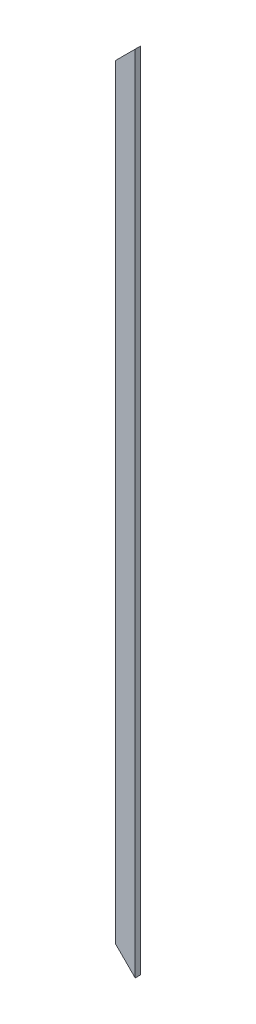
ISO-10303-21;
HEADER;
FILE_DESCRIPTION(('STEP AP214'),'2;1');
FILE_NAME('part.step','',(''),(''),'','','');
FILE_SCHEMA(('AUTOMOTIVE_DESIGN { 1 0 10303 214 1 1 1 1 }'));
ENDSEC;
DATA;
#1=APPLICATION_CONTEXT('core data for automotive mechanical design processes');
#2=APPLICATION_PROTOCOL_DEFINITION('international standard','automotive_design',2000,#1);
#3=PRODUCT_CONTEXT('',#1,'mechanical');
#4=PRODUCT('Part','Part','',(#3));
#5=PRODUCT_RELATED_PRODUCT_CATEGORY('part','',(#4));
#6=PRODUCT_DEFINITION_FORMATION('','',#4);
#7=PRODUCT_DEFINITION_CONTEXT('part definition',#1,'design');
#8=PRODUCT_DEFINITION('design','',#6,#7);
#9=PRODUCT_DEFINITION_SHAPE('','',#8);
#10=(LENGTH_UNIT() NAMED_UNIT(*) SI_UNIT(.MILLI.,.METRE.));
#11=(NAMED_UNIT(*) PLANE_ANGLE_UNIT() SI_UNIT($,.RADIAN.));
#12=(NAMED_UNIT(*) SI_UNIT($,.STERADIAN.) SOLID_ANGLE_UNIT());
#13=UNCERTAINTY_MEASURE_WITH_UNIT(LENGTH_MEASURE(1.E-05),#10,'distance_accuracy_value','');
#14=(GEOMETRIC_REPRESENTATION_CONTEXT(3) GLOBAL_UNCERTAINTY_ASSIGNED_CONTEXT((#13)) GLOBAL_UNIT_ASSIGNED_CONTEXT((#10,
#11,#12)) REPRESENTATION_CONTEXT('',''));
#15=CARTESIAN_POINT('',(0.,0.,0.));
#16=DIRECTION('',(0.,0.,1.));
#17=DIRECTION('',(1.,0.,0.));
#18=AXIS2_PLACEMENT_3D('',#15,#16,#17);
#19=CARTESIAN_POINT('',(-69.85,5664.2,19.05));
#20=DIRECTION('',(-1.,0.,0.));
#21=DIRECTION('',(0.,0.,1.));
#22=AXIS2_PLACEMENT_3D('',#19,#20,#21);
#23=PLANE('',#22);
#24=DIRECTION('',(0.,0.,1.));
#25=VECTOR('',#24,1.);
#26=CARTESIAN_POINT('',(-69.85,5524.5,-19.05));
#27=LINE('',#26,#25);
#28=CARTESIAN_POINT('',(-69.85,5524.5,-19.05));
#29=VERTEX_POINT('',#28);
#30=CARTESIAN_POINT('',(-69.85,5524.5,19.05));
#31=VERTEX_POINT('',#30);
#32=EDGE_CURVE('E76',#29,#31,#27,.T.);
#33=ORIENTED_EDGE('',*,*,#32,.F.);
#34=DIRECTION('',(0.,-1.,0.));
#35=VECTOR('',#34,1.);
#36=CARTESIAN_POINT('',(-69.85,5664.2,-19.05));
#37=LINE('',#36,#35);
#38=CARTESIAN_POINT('',(-69.8500000000007,139.700000000001,-19.05));
#39=VERTEX_POINT('',#38);
#40=EDGE_CURVE('E40',#29,#39,#37,.T.);
#41=ORIENTED_EDGE('',*,*,#40,.T.);
#42=DIRECTION('',(0.,0.,1.));
#43=VECTOR('',#42,1.);
#44=CARTESIAN_POINT('',(-69.8500000000007,139.700000000001,-19.05));
#45=LINE('',#44,#43);
#46=CARTESIAN_POINT('',(-69.8500000000007,139.700000000001,19.05));
#47=VERTEX_POINT('',#46);
#48=EDGE_CURVE('E110',#39,#47,#45,.T.);
#49=ORIENTED_EDGE('',*,*,#48,.T.);
#50=DIRECTION('',(0.,-1.,0.));
#51=VECTOR('',#50,1.);
#52=CARTESIAN_POINT('',(-69.85,5664.2,19.05));
#53=LINE('',#52,#51);
#54=EDGE_CURVE('E11',#31,#47,#53,.T.);
#55=ORIENTED_EDGE('',*,*,#54,.F.);
#56=EDGE_LOOP('',(#33,#41,#49,#55));
#57=FACE_BOUND('',#56,.T.);
#58=ADVANCED_FACE('F37',(#57),#23,.T.);
#59=CARTESIAN_POINT('',(-69.85,5664.2,19.05));
#60=DIRECTION('',(0.,0.,-1.));
#61=DIRECTION('',(-1.,0.,0.));
#62=AXIS2_PLACEMENT_3D('',#59,#60,#61);
#63=PLANE('',#62);
#64=DIRECTION('',(0.,-1.,0.));
#65=VECTOR('',#64,1.);
#66=CARTESIAN_POINT('',(69.85,5664.2,19.05));
#67=LINE('',#66,#65);
#68=CARTESIAN_POINT('',(69.85,5664.2,19.05));
#69=VERTEX_POINT('',#68);
#70=CARTESIAN_POINT('',(69.85,0.,19.05));
#71=VERTEX_POINT('',#70);
#72=EDGE_CURVE('E46',#69,#71,#67,.T.);
#73=ORIENTED_EDGE('',*,*,#72,.F.);
#74=DIRECTION('',(-0.707106781186547,-0.707106781186549,0.));
#75=VECTOR('',#74,1.);
#76=CARTESIAN_POINT('',(2.08166817117217E-13,5594.35,19.05));
#77=LINE('',#76,#75);
#78=EDGE_CURVE('E53',#69,#31,#77,.T.);
#79=ORIENTED_EDGE('',*,*,#78,.T.);
#80=ORIENTED_EDGE('',*,*,#54,.T.);
#81=DIRECTION('',(0.707106781186546,-0.707106781186548,0.));
#82=VECTOR('',#81,1.);
#83=CARTESIAN_POINT('',(-2832.1,2901.95000000001,19.05));
#84=LINE('',#83,#82);
#85=EDGE_CURVE('E89',#47,#71,#84,.T.);
#86=ORIENTED_EDGE('',*,*,#85,.T.);
#87=EDGE_LOOP('',(#73,#79,#80,#86));
#88=FACE_BOUND('',#87,.T.);
#89=ADVANCED_FACE('F106',(#88),#63,.F.);
#90=CARTESIAN_POINT('',(69.85,5664.2,19.05));
#91=DIRECTION('',(-1.,0.,0.));
#92=DIRECTION('',(0.,0.,1.));
#93=AXIS2_PLACEMENT_3D('',#90,#91,#92);
#94=PLANE('',#93);
#95=DIRECTION('',(0.,0.,-1.));
#96=VECTOR('',#95,1.);
#97=CARTESIAN_POINT('',(69.85,0.,19.05));
#98=LINE('',#97,#96);
#99=CARTESIAN_POINT('',(69.85,0.,-19.05));
#100=VERTEX_POINT('',#99);
#101=EDGE_CURVE('E94',#71,#100,#98,.T.);
#102=ORIENTED_EDGE('',*,*,#101,.T.);
#103=DIRECTION('',(0.,-1.,0.));
#104=VECTOR('',#103,1.);
#105=CARTESIAN_POINT('',(69.85,5664.2,-19.05));
#106=LINE('',#105,#104);
#107=CARTESIAN_POINT('',(69.85,5664.2,-19.05));
#108=VERTEX_POINT('',#107);
#109=EDGE_CURVE('E93',#108,#100,#106,.T.);
#110=ORIENTED_EDGE('',*,*,#109,.F.);
#111=DIRECTION('',(0.,0.,-1.));
#112=VECTOR('',#111,1.);
#113=CARTESIAN_POINT('',(69.85,5664.2,19.05));
#114=LINE('',#113,#112);
#115=EDGE_CURVE('E78',#69,#108,#114,.T.);
#116=ORIENTED_EDGE('',*,*,#115,.F.);
#117=ORIENTED_EDGE('',*,*,#72,.T.);
#118=EDGE_LOOP('',(#102,#110,#116,#117));
#119=FACE_BOUND('',#118,.T.);
#120=ADVANCED_FACE('F103',(#119),#94,.F.);
#121=CARTESIAN_POINT('',(-69.85,5664.2,-19.05));
#122=DIRECTION('',(0.,0.,-1.));
#123=DIRECTION('',(-1.,0.,0.));
#124=AXIS2_PLACEMENT_3D('',#121,#122,#123);
#125=PLANE('',#124);
#126=DIRECTION('',(0.707106781186547,0.707106781186549,0.));
#127=VECTOR('',#126,1.);
#128=CARTESIAN_POINT('',(69.85,5664.2,-19.05));
#129=LINE('',#128,#127);
#130=EDGE_CURVE('E73',#29,#108,#129,.T.);
#131=ORIENTED_EDGE('',*,*,#130,.T.);
#132=ORIENTED_EDGE('',*,*,#109,.T.);
#133=DIRECTION('',(-0.707106781186546,0.707106781186548,0.));
#134=VECTOR('',#133,1.);
#135=CARTESIAN_POINT('',(69.85,0.,-19.05));
#136=LINE('',#135,#134);
#137=EDGE_CURVE('E83',#100,#39,#136,.T.);
#138=ORIENTED_EDGE('',*,*,#137,.T.);
#139=ORIENTED_EDGE('',*,*,#40,.F.);
#140=EDGE_LOOP('',(#131,#132,#138,#139));
#141=FACE_BOUND('',#140,.T.);
#142=ADVANCED_FACE('F92',(#141),#125,.T.);
#143=CARTESIAN_POINT('',(69.85,0.,-19.05));
#144=DIRECTION('',(0.707106781186548,0.707106781186546,0.));
#145=DIRECTION('',(-0.707106781186547,0.707106781186549,0.));
#146=AXIS2_PLACEMENT_3D('',#143,#144,#145);
#147=PLANE('',#146);
#148=ORIENTED_EDGE('',*,*,#48,.F.);
#149=ORIENTED_EDGE('',*,*,#137,.F.);
#150=ORIENTED_EDGE('',*,*,#101,.F.);
#151=ORIENTED_EDGE('',*,*,#85,.F.);
#152=EDGE_LOOP('',(#148,#149,#150,#151));
#153=FACE_BOUND('',#152,.T.);
#154=ADVANCED_FACE('F111',(#153),#147,.F.);
#155=CARTESIAN_POINT('',(69.85,5664.2,-19.05));
#156=DIRECTION('',(0.707106781186549,-0.707106781186547,0.));
#157=DIRECTION('',(0.707106781186547,0.707106781186549,0.));
#158=AXIS2_PLACEMENT_3D('',#155,#156,#157);
#159=PLANE('',#158);
#160=ORIENTED_EDGE('',*,*,#115,.T.);
#161=ORIENTED_EDGE('',*,*,#130,.F.);
#162=ORIENTED_EDGE('',*,*,#32,.T.);
#163=ORIENTED_EDGE('',*,*,#78,.F.);
#164=EDGE_LOOP('',(#160,#161,#162,#163));
#165=FACE_BOUND('',#164,.T.);
#166=ADVANCED_FACE('F75',(#165),#159,.F.);
#167=CLOSED_SHELL('',(#58,#89,#120,#142,#154,#166));
#168=MANIFOLD_SOLID_BREP('B2',#167);
#169=ADVANCED_BREP_SHAPE_REPRESENTATION('',(#18,#168),#14);
#170=SHAPE_DEFINITION_REPRESENTATION(#9,#169);
ENDSEC;
END-ISO-10303-21;
